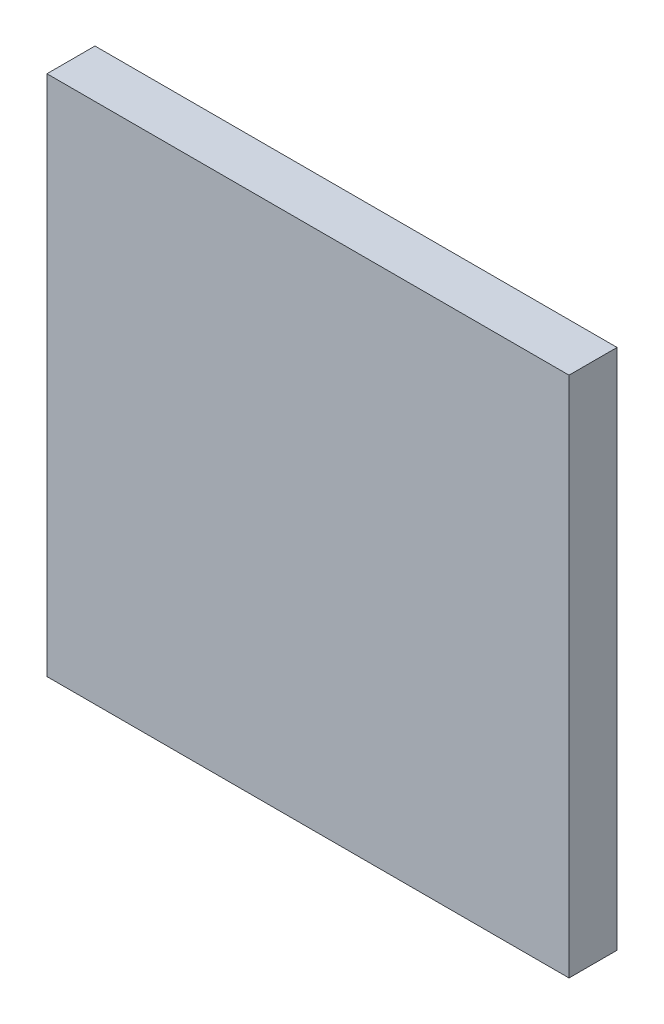
ISO-10303-21;
HEADER;
FILE_DESCRIPTION(('STEP AP214'),'2;1');
FILE_NAME('part.step','',(''),(''),'','','');
FILE_SCHEMA(('AUTOMOTIVE_DESIGN { 1 0 10303 214 1 1 1 1 }'));
ENDSEC;
DATA;
#1=APPLICATION_CONTEXT('core data for automotive mechanical design processes');
#2=APPLICATION_PROTOCOL_DEFINITION('international standard','automotive_design',2000,#1);
#3=PRODUCT_CONTEXT('',#1,'mechanical');
#4=PRODUCT('Part','Part','',(#3));
#5=PRODUCT_RELATED_PRODUCT_CATEGORY('part','',(#4));
#6=PRODUCT_DEFINITION_FORMATION('','',#4);
#7=PRODUCT_DEFINITION_CONTEXT('part definition',#1,'design');
#8=PRODUCT_DEFINITION('design','',#6,#7);
#9=PRODUCT_DEFINITION_SHAPE('','',#8);
#10=(LENGTH_UNIT() NAMED_UNIT(*) SI_UNIT(.MILLI.,.METRE.));
#11=(NAMED_UNIT(*) PLANE_ANGLE_UNIT() SI_UNIT($,.RADIAN.));
#12=(NAMED_UNIT(*) SI_UNIT($,.STERADIAN.) SOLID_ANGLE_UNIT());
#13=UNCERTAINTY_MEASURE_WITH_UNIT(LENGTH_MEASURE(1.E-05),#10,'distance_accuracy_value','');
#14=(GEOMETRIC_REPRESENTATION_CONTEXT(3) GLOBAL_UNCERTAINTY_ASSIGNED_CONTEXT((#13)) GLOBAL_UNIT_ASSIGNED_CONTEXT((#10,
#11,#12)) REPRESENTATION_CONTEXT('',''));
#15=CARTESIAN_POINT('',(0.,0.,0.));
#16=DIRECTION('',(0.,0.,1.));
#17=DIRECTION('',(1.,0.,0.));
#18=AXIS2_PLACEMENT_3D('',#15,#16,#17);
#19=CARTESIAN_POINT('',(88.7479357758851,74.0632418345266,2.3));
#20=DIRECTION('',(1.,0.,0.));
#21=DIRECTION('',(0.,1.,0.));
#22=AXIS2_PLACEMENT_3D('',#19,#20,#21);
#23=PLANE('',#22);
#24=DIRECTION('',(0.,-1.,0.));
#25=VECTOR('',#24,1.);
#26=CARTESIAN_POINT('',(88.7479357758851,74.0632418345266,0.));
#27=LINE('',#26,#25);
#28=CARTESIAN_POINT('',(88.7479357758851,74.0632418345266,0.));
#29=VERTEX_POINT('',#28);
#30=CARTESIAN_POINT('',(88.7479357758851,49.0632418345266,0.));
#31=VERTEX_POINT('',#30);
#32=EDGE_CURVE('E100',#29,#31,#27,.T.);
#33=ORIENTED_EDGE('',*,*,#32,.T.);
#34=DIRECTION('',(0.,0.,-1.));
#35=VECTOR('',#34,1.);
#36=CARTESIAN_POINT('',(88.7479357758851,49.0632418345266,2.3));
#37=LINE('',#36,#35);
#38=CARTESIAN_POINT('',(88.7479357758851,49.0632418345266,2.3));
#39=VERTEX_POINT('',#38);
#40=EDGE_CURVE('E11',#39,#31,#37,.T.);
#41=ORIENTED_EDGE('',*,*,#40,.F.);
#42=DIRECTION('',(0.,-1.,0.));
#43=VECTOR('',#42,1.);
#44=CARTESIAN_POINT('',(88.7479357758851,74.0632418345266,2.3));
#45=LINE('',#44,#43);
#46=CARTESIAN_POINT('',(88.7479357758851,74.0632418345266,2.3));
#47=VERTEX_POINT('',#46);
#48=EDGE_CURVE('E88',#47,#39,#45,.T.);
#49=ORIENTED_EDGE('',*,*,#48,.F.);
#50=DIRECTION('',(0.,0.,-1.));
#51=VECTOR('',#50,1.);
#52=CARTESIAN_POINT('',(88.7479357758851,74.0632418345266,2.3));
#53=LINE('',#52,#51);
#54=EDGE_CURVE('E96',#47,#29,#53,.T.);
#55=ORIENTED_EDGE('',*,*,#54,.T.);
#56=EDGE_LOOP('',(#33,#41,#49,#55));
#57=FACE_BOUND('',#56,.T.);
#58=ADVANCED_FACE('F37',(#57),#23,.F.);
#59=CARTESIAN_POINT('',(88.7479357758851,49.0632418345266,2.3));
#60=DIRECTION('',(0.,1.,0.));
#61=DIRECTION('',(0.,0.,1.));
#62=AXIS2_PLACEMENT_3D('',#59,#60,#61);
#63=PLANE('',#62);
#64=DIRECTION('',(1.,0.,0.));
#65=VECTOR('',#64,1.);
#66=CARTESIAN_POINT('',(88.7479357758851,49.0632418345266,0.));
#67=LINE('',#66,#65);
#68=CARTESIAN_POINT('',(113.747935775885,49.0632418345266,0.));
#69=VERTEX_POINT('',#68);
#70=EDGE_CURVE('E92',#31,#69,#67,.T.);
#71=ORIENTED_EDGE('',*,*,#70,.T.);
#72=DIRECTION('',(0.,0.,-1.));
#73=VECTOR('',#72,1.);
#74=CARTESIAN_POINT('',(113.747935775885,49.0632418345266,2.3));
#75=LINE('',#74,#73);
#76=CARTESIAN_POINT('',(113.747935775885,49.0632418345266,2.3));
#77=VERTEX_POINT('',#76);
#78=EDGE_CURVE('E45',#77,#69,#75,.T.);
#79=ORIENTED_EDGE('',*,*,#78,.F.);
#80=DIRECTION('',(1.,0.,0.));
#81=VECTOR('',#80,1.);
#82=CARTESIAN_POINT('',(88.7479357758851,49.0632418345266,2.3));
#83=LINE('',#82,#81);
#84=EDGE_CURVE('E83',#39,#77,#83,.T.);
#85=ORIENTED_EDGE('',*,*,#84,.F.);
#86=ORIENTED_EDGE('',*,*,#40,.T.);
#87=EDGE_LOOP('',(#71,#79,#85,#86));
#88=FACE_BOUND('',#87,.T.);
#89=ADVANCED_FACE('F91',(#88),#63,.F.);
#90=CARTESIAN_POINT('',(113.747935775885,74.0632418345266,2.3));
#91=DIRECTION('',(-1.,0.,0.));
#92=DIRECTION('',(0.,-1.,0.));
#93=AXIS2_PLACEMENT_3D('',#90,#91,#92);
#94=PLANE('',#93);
#95=DIRECTION('',(0.,1.,0.));
#96=VECTOR('',#95,1.);
#97=CARTESIAN_POINT('',(113.747935775885,74.0632418345266,0.));
#98=LINE('',#97,#96);
#99=CARTESIAN_POINT('',(113.747935775885,74.0632418345266,0.));
#100=VERTEX_POINT('',#99);
#101=EDGE_CURVE('E70',#69,#100,#98,.T.);
#102=ORIENTED_EDGE('',*,*,#101,.T.);
#103=DIRECTION('',(0.,0.,-1.));
#104=VECTOR('',#103,1.);
#105=CARTESIAN_POINT('',(113.747935775885,74.0632418345266,2.3));
#106=LINE('',#105,#104);
#107=CARTESIAN_POINT('',(113.747935775885,74.0632418345266,2.3));
#108=VERTEX_POINT('',#107);
#109=EDGE_CURVE('E93',#108,#100,#106,.T.);
#110=ORIENTED_EDGE('',*,*,#109,.F.);
#111=DIRECTION('',(0.,1.,0.));
#112=VECTOR('',#111,1.);
#113=CARTESIAN_POINT('',(113.747935775885,74.0632418345266,2.3));
#114=LINE('',#113,#112);
#115=EDGE_CURVE('E86',#77,#108,#114,.T.);
#116=ORIENTED_EDGE('',*,*,#115,.F.);
#117=ORIENTED_EDGE('',*,*,#78,.T.);
#118=EDGE_LOOP('',(#102,#110,#116,#117));
#119=FACE_BOUND('',#118,.T.);
#120=ADVANCED_FACE('F94',(#119),#94,.F.);
#121=CARTESIAN_POINT('',(88.7479357758851,74.0632418345266,2.3));
#122=DIRECTION('',(0.,-1.,0.));
#123=DIRECTION('',(0.,0.,-1.));
#124=AXIS2_PLACEMENT_3D('',#121,#122,#123);
#125=PLANE('',#124);
#126=DIRECTION('',(-1.,0.,0.));
#127=VECTOR('',#126,1.);
#128=CARTESIAN_POINT('',(88.7479357758851,74.0632418345266,0.));
#129=LINE('',#128,#127);
#130=EDGE_CURVE('E76',#100,#29,#129,.T.);
#131=ORIENTED_EDGE('',*,*,#130,.T.);
#132=ORIENTED_EDGE('',*,*,#54,.F.);
#133=DIRECTION('',(-1.,0.,0.));
#134=VECTOR('',#133,1.);
#135=CARTESIAN_POINT('',(88.7479357758851,74.0632418345266,2.3));
#136=LINE('',#135,#134);
#137=EDGE_CURVE('E53',#108,#47,#136,.T.);
#138=ORIENTED_EDGE('',*,*,#137,.F.);
#139=ORIENTED_EDGE('',*,*,#109,.T.);
#140=EDGE_LOOP('',(#131,#132,#138,#139));
#141=FACE_BOUND('',#140,.T.);
#142=ADVANCED_FACE('F107',(#141),#125,.F.);
#143=CARTESIAN_POINT('',(0.,0.,2.3));
#144=DIRECTION('',(0.,0.,1.));
#145=DIRECTION('',(1.,0.,0.));
#146=AXIS2_PLACEMENT_3D('',#143,#144,#145);
#147=PLANE('',#146);
#148=ORIENTED_EDGE('',*,*,#48,.T.);
#149=ORIENTED_EDGE('',*,*,#84,.T.);
#150=ORIENTED_EDGE('',*,*,#115,.T.);
#151=ORIENTED_EDGE('',*,*,#137,.T.);
#152=EDGE_LOOP('',(#148,#149,#150,#151));
#153=FACE_BOUND('',#152,.T.);
#154=ADVANCED_FACE('F84',(#153),#147,.T.);
#155=CARTESIAN_POINT('',(0.,0.,0.));
#156=DIRECTION('',(0.,0.,1.));
#157=DIRECTION('',(1.,0.,0.));
#158=AXIS2_PLACEMENT_3D('',#155,#156,#157);
#159=PLANE('',#158);
#160=ORIENTED_EDGE('',*,*,#32,.F.);
#161=ORIENTED_EDGE('',*,*,#130,.F.);
#162=ORIENTED_EDGE('',*,*,#101,.F.);
#163=ORIENTED_EDGE('',*,*,#70,.F.);
#164=EDGE_LOOP('',(#160,#161,#162,#163));
#165=FACE_BOUND('',#164,.T.);
#166=ADVANCED_FACE('F110',(#165),#159,.F.);
#167=CLOSED_SHELL('',(#58,#89,#120,#142,#154,#166));
#168=MANIFOLD_SOLID_BREP('B2',#167);
#169=ADVANCED_BREP_SHAPE_REPRESENTATION('',(#18,#168),#14);
#170=SHAPE_DEFINITION_REPRESENTATION(#9,#169);
ENDSEC;
END-ISO-10303-21;
